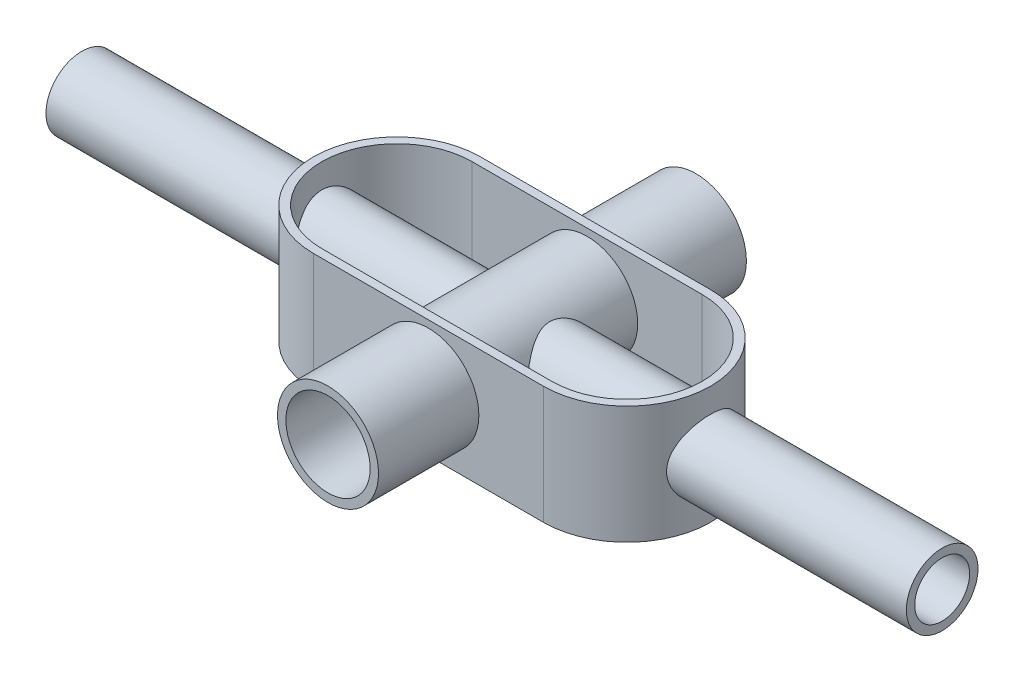
ISO-10303-21;
HEADER;
FILE_DESCRIPTION(('STEP AP214'),'2;1');
FILE_NAME('part.step','',(''),(''),'','','');
FILE_SCHEMA(('AUTOMOTIVE_DESIGN { 1 0 10303 214 1 1 1 1 }'));
ENDSEC;
DATA;
#1=APPLICATION_CONTEXT('core data for automotive mechanical design processes');
#2=APPLICATION_PROTOCOL_DEFINITION('international standard','automotive_design',2000,#1);
#3=PRODUCT_CONTEXT('',#1,'mechanical');
#4=PRODUCT('Part','Part','',(#3));
#5=PRODUCT_RELATED_PRODUCT_CATEGORY('part','',(#4));
#6=PRODUCT_DEFINITION_FORMATION('','',#4);
#7=PRODUCT_DEFINITION_CONTEXT('part definition',#1,'design');
#8=PRODUCT_DEFINITION('design','',#6,#7);
#9=PRODUCT_DEFINITION_SHAPE('','',#8);
#10=(LENGTH_UNIT() NAMED_UNIT(*) SI_UNIT(.MILLI.,.METRE.));
#11=(NAMED_UNIT(*) PLANE_ANGLE_UNIT() SI_UNIT($,.RADIAN.));
#12=(NAMED_UNIT(*) SI_UNIT($,.STERADIAN.) SOLID_ANGLE_UNIT());
#13=UNCERTAINTY_MEASURE_WITH_UNIT(LENGTH_MEASURE(1.E-05),#10,'distance_accuracy_value','');
#14=(GEOMETRIC_REPRESENTATION_CONTEXT(3) GLOBAL_UNCERTAINTY_ASSIGNED_CONTEXT((#13)) GLOBAL_UNIT_ASSIGNED_CONTEXT((#10,
#11,#12)) REPRESENTATION_CONTEXT('',''));
#15=CARTESIAN_POINT('',(0.,0.,0.));
#16=DIRECTION('',(0.,0.,1.));
#17=DIRECTION('',(1.,0.,0.));
#18=AXIS2_PLACEMENT_3D('',#15,#16,#17);
#19=CARTESIAN_POINT('',(0.,18.2999372416086,55.88));
#20=DIRECTION('',(0.,0.,1.));
#21=DIRECTION('',(1.,0.,0.));
#22=AXIS2_PLACEMENT_3D('',#19,#20,#21);
#23=PLANE('',#22);
#24=CARTESIAN_POINT('',(0.,18.2999372416086,55.88));
#25=DIRECTION('',(0.,0.,1.));
#26=DIRECTION('',(1.,0.,0.));
#27=AXIS2_PLACEMENT_3D('',#24,#25,#26);
#28=CIRCLE('',#27,15.3388705459082);
#29=CARTESIAN_POINT('',(15.3388705459082,18.2999372416086,55.88));
#30=VERTEX_POINT('',#29);
#31=EDGE_CURVE('E12',#30,#30,#28,.T.);
#32=ORIENTED_EDGE('',*,*,#31,.T.);
#33=EDGE_LOOP('',(#32));
#34=FACE_BOUND('',#33,.T.);
#35=CARTESIAN_POINT('',(0.,18.2999372416086,55.88));
#36=DIRECTION('',(0.,0.,1.));
#37=DIRECTION('',(1.,0.,0.));
#38=AXIS2_PLACEMENT_3D('',#35,#36,#37);
#39=CIRCLE('',#38,12.7988705459082);
#40=CARTESIAN_POINT('',(12.7988705459082,18.2999372416086,55.88));
#41=VERTEX_POINT('',#40);
#42=EDGE_CURVE('E71',#41,#41,#39,.T.);
#43=ORIENTED_EDGE('',*,*,#42,.F.);
#44=EDGE_LOOP('',(#43));
#45=FACE_BOUND('',#44,.T.);
#46=ADVANCED_FACE('F60',(#34,#45),#23,.T.);
#47=CARTESIAN_POINT('',(0.,18.2999372416086,-55.88));
#48=DIRECTION('',(0.,0.,1.));
#49=DIRECTION('',(1.,0.,0.));
#50=AXIS2_PLACEMENT_3D('',#47,#48,#49);
#51=PLANE('',#50);
#52=CARTESIAN_POINT('',(0.,18.2999372416086,-55.88));
#53=DIRECTION('',(0.,0.,1.));
#54=DIRECTION('',(1.,0.,0.));
#55=AXIS2_PLACEMENT_3D('',#52,#53,#54);
#56=CIRCLE('',#55,15.3388705459082);
#57=CARTESIAN_POINT('',(15.3388705459082,18.2999372416086,-55.88));
#58=VERTEX_POINT('',#57);
#59=EDGE_CURVE('E64',#58,#58,#56,.T.);
#60=ORIENTED_EDGE('',*,*,#59,.F.);
#61=EDGE_LOOP('',(#60));
#62=FACE_BOUND('',#61,.T.);
#63=CARTESIAN_POINT('',(0.,18.2999372416086,-55.88));
#64=DIRECTION('',(0.,0.,1.));
#65=DIRECTION('',(1.,0.,0.));
#66=AXIS2_PLACEMENT_3D('',#63,#64,#65);
#67=CIRCLE('',#66,12.7988705459082);
#68=CARTESIAN_POINT('',(12.7988705459082,18.2999372416086,-55.88));
#69=VERTEX_POINT('',#68);
#70=EDGE_CURVE('E73',#69,#69,#67,.T.);
#71=ORIENTED_EDGE('',*,*,#70,.T.);
#72=EDGE_LOOP('',(#71));
#73=FACE_BOUND('',#72,.T.);
#74=ADVANCED_FACE('F83',(#62,#73),#51,.F.);
#75=CARTESIAN_POINT('',(0.,18.2999372416086,55.88));
#76=DIRECTION('',(0.,0.,-1.));
#77=DIRECTION('',(-1.,0.,0.));
#78=AXIS2_PLACEMENT_3D('',#75,#76,#77);
#79=CYLINDRICAL_SURFACE('',#78,15.3388705459082);
#80=ORIENTED_EDGE('',*,*,#31,.F.);
#81=EDGE_LOOP('',(#80));
#82=FACE_BOUND('',#81,.T.);
#83=ORIENTED_EDGE('',*,*,#59,.T.);
#84=EDGE_LOOP('',(#83));
#85=FACE_BOUND('',#84,.T.);
#86=ADVANCED_FACE('F62',(#82,#85),#79,.T.);
#87=CARTESIAN_POINT('',(0.,18.2999372416086,55.88));
#88=DIRECTION('',(0.,0.,-1.));
#89=DIRECTION('',(-1.,0.,0.));
#90=AXIS2_PLACEMENT_3D('',#87,#88,#89);
#91=CYLINDRICAL_SURFACE('',#90,12.7988705459082);
#92=ORIENTED_EDGE('',*,*,#42,.T.);
#93=EDGE_LOOP('',(#92));
#94=FACE_BOUND('',#93,.T.);
#95=ORIENTED_EDGE('',*,*,#70,.F.);
#96=EDGE_LOOP('',(#95));
#97=FACE_BOUND('',#96,.T.);
#98=ADVANCED_FACE('F79',(#94,#97),#91,.F.);
#99=CLOSED_SHELL('',(#46,#74,#86,#98));
#100=MANIFOLD_SOLID_BREP('B2_NOT_SHOWN',#99);
#101=CARTESIAN_POINT('',(-34.9421284780553,35.814,0.));
#102=DIRECTION('',(0.,-1.,0.));
#103=DIRECTION('',(0.,0.,-1.));
#104=AXIS2_PLACEMENT_3D('',#101,#102,#103);
#105=CYLINDRICAL_SURFACE('',#104,25.3926070383726);
#106=CARTESIAN_POINT('',(-34.9421284780553,0.,0.));
#107=DIRECTION('',(0.,1.,0.));
#108=DIRECTION('',(0.,0.,1.));
#109=AXIS2_PLACEMENT_3D('',#106,#107,#108);
#110=CIRCLE('',#109,25.3926070383726);
#111=CARTESIAN_POINT('',(-34.9421284780553,0.,-25.3926070383726));
#112=VERTEX_POINT('',#111);
#113=CARTESIAN_POINT('',(-34.9421284780553,0.,25.3926070383726));
#114=VERTEX_POINT('',#113);
#115=EDGE_CURVE('E243',#112,#114,#110,.T.);
#116=ORIENTED_EDGE('',*,*,#115,.T.);
#117=DIRECTION('',(0.,-1.,0.));
#118=VECTOR('',#117,1.);
#119=CARTESIAN_POINT('',(-34.9421284780553,35.814,25.3926070383726));
#120=LINE('',#119,#118);
#121=CARTESIAN_POINT('',(-34.9421284780553,35.814,25.3926070383726));
#122=VERTEX_POINT('',#121);
#123=EDGE_CURVE('E58',#122,#114,#120,.T.);
#124=ORIENTED_EDGE('',*,*,#123,.F.);
#125=CARTESIAN_POINT('',(-34.9421284780553,35.814,0.));
#126=DIRECTION('',(0.,1.,0.));
#127=DIRECTION('',(0.,0.,1.));
#128=AXIS2_PLACEMENT_3D('',#125,#126,#127);
#129=CIRCLE('',#128,25.3926070383726);
#130=CARTESIAN_POINT('',(-34.9421284780553,35.814,-25.3926070383726));
#131=VERTEX_POINT('',#130);
#132=EDGE_CURVE('E236',#131,#122,#129,.T.);
#133=ORIENTED_EDGE('',*,*,#132,.F.);
#134=DIRECTION('',(0.,-1.,0.));
#135=VECTOR('',#134,1.);
#136=CARTESIAN_POINT('',(-34.9421284780553,35.814,-25.3926070383726));
#137=LINE('',#136,#135);
#138=EDGE_CURVE('E242',#131,#112,#137,.T.);
#139=ORIENTED_EDGE('',*,*,#138,.T.);
#140=EDGE_LOOP('',(#116,#124,#133,#139));
#141=FACE_BOUND('',#140,.T.);
#142=ADVANCED_FACE('F129',(#141),#105,.T.);
#143=CARTESIAN_POINT('',(-34.9421284780553,35.814,25.3926070383726));
#144=DIRECTION('',(0.,0.,-1.));
#145=DIRECTION('',(-1.,0.,0.));
#146=AXIS2_PLACEMENT_3D('',#143,#144,#145);
#147=PLANE('',#146);
#148=DIRECTION('',(1.,0.,0.));
#149=VECTOR('',#148,1.);
#150=CARTESIAN_POINT('',(-34.9421284780553,0.,25.3926070383726));
#151=LINE('',#150,#149);
#152=CARTESIAN_POINT('',(34.9421284780553,0.,25.3926070383726));
#153=VERTEX_POINT('',#152);
#154=EDGE_CURVE('E246',#114,#153,#151,.T.);
#155=ORIENTED_EDGE('',*,*,#154,.T.);
#156=DIRECTION('',(0.,-1.,0.));
#157=VECTOR('',#156,1.);
#158=CARTESIAN_POINT('',(34.9421284780553,35.814,25.3926070383726));
#159=LINE('',#158,#157);
#160=CARTESIAN_POINT('',(34.9421284780553,35.814,25.3926070383726));
#161=VERTEX_POINT('',#160);
#162=EDGE_CURVE('E136',#161,#153,#159,.T.);
#163=ORIENTED_EDGE('',*,*,#162,.F.);
#164=DIRECTION('',(1.,0.,0.));
#165=VECTOR('',#164,1.);
#166=CARTESIAN_POINT('',(-34.9421284780553,35.814,25.3926070383726));
#167=LINE('',#166,#165);
#168=EDGE_CURVE('E180',#122,#161,#167,.T.);
#169=ORIENTED_EDGE('',*,*,#168,.F.);
#170=ORIENTED_EDGE('',*,*,#123,.T.);
#171=EDGE_LOOP('',(#155,#163,#169,#170));
#172=FACE_BOUND('',#171,.T.);
#173=ADVANCED_FACE('F275',(#172),#147,.F.);
#174=CARTESIAN_POINT('',(34.9421284780553,35.814,0.));
#175=DIRECTION('',(0.,-1.,0.));
#176=DIRECTION('',(0.,0.,-1.));
#177=AXIS2_PLACEMENT_3D('',#174,#175,#176);
#178=CYLINDRICAL_SURFACE('',#177,25.3926070383726);
#179=CARTESIAN_POINT('',(34.9421284780553,0.,0.));
#180=DIRECTION('',(0.,1.,0.));
#181=DIRECTION('',(0.,0.,1.));
#182=AXIS2_PLACEMENT_3D('',#179,#180,#181);
#183=CIRCLE('',#182,25.3926070383726);
#184=CARTESIAN_POINT('',(34.9421284780553,0.,-25.3926070383726));
#185=VERTEX_POINT('',#184);
#186=EDGE_CURVE('E248',#153,#185,#183,.T.);
#187=ORIENTED_EDGE('',*,*,#186,.T.);
#188=DIRECTION('',(0.,-1.,0.));
#189=VECTOR('',#188,1.);
#190=CARTESIAN_POINT('',(34.9421284780553,35.814,-25.3926070383726));
#191=LINE('',#190,#189);
#192=CARTESIAN_POINT('',(34.9421284780553,35.814,-25.3926070383726));
#193=VERTEX_POINT('',#192);
#194=EDGE_CURVE('E252',#193,#185,#191,.T.);
#195=ORIENTED_EDGE('',*,*,#194,.F.);
#196=CARTESIAN_POINT('',(34.9421284780553,35.814,0.));
#197=DIRECTION('',(0.,1.,0.));
#198=DIRECTION('',(0.,0.,1.));
#199=AXIS2_PLACEMENT_3D('',#196,#197,#198);
#200=CIRCLE('',#199,25.3926070383726);
#201=EDGE_CURVE('E239',#161,#193,#200,.T.);
#202=ORIENTED_EDGE('',*,*,#201,.F.);
#203=ORIENTED_EDGE('',*,*,#162,.T.);
#204=EDGE_LOOP('',(#187,#195,#202,#203));
#205=FACE_BOUND('',#204,.T.);
#206=ADVANCED_FACE('F257',(#205),#178,.T.);
#207=CARTESIAN_POINT('',(-34.9421284780553,35.814,-25.3926070383726));
#208=DIRECTION('',(0.,0.,1.));
#209=DIRECTION('',(1.,0.,0.));
#210=AXIS2_PLACEMENT_3D('',#207,#208,#209);
#211=PLANE('',#210);
#212=DIRECTION('',(-1.,0.,0.));
#213=VECTOR('',#212,1.);
#214=CARTESIAN_POINT('',(-34.9421284780553,0.,-25.3926070383726));
#215=LINE('',#214,#213);
#216=EDGE_CURVE('E173',#185,#112,#215,.T.);
#217=ORIENTED_EDGE('',*,*,#216,.T.);
#218=ORIENTED_EDGE('',*,*,#138,.F.);
#219=DIRECTION('',(-1.,0.,0.));
#220=VECTOR('',#219,1.);
#221=CARTESIAN_POINT('',(-34.9421284780553,35.814,-25.3926070383726));
#222=LINE('',#221,#220);
#223=EDGE_CURVE('E152',#193,#131,#222,.T.);
#224=ORIENTED_EDGE('',*,*,#223,.F.);
#225=ORIENTED_EDGE('',*,*,#194,.T.);
#226=EDGE_LOOP('',(#217,#218,#224,#225));
#227=FACE_BOUND('',#226,.T.);
#228=ADVANCED_FACE('F265',(#227),#211,.F.);
#229=CARTESIAN_POINT('',(-34.9421284780553,35.814,0.));
#230=DIRECTION('',(0.,1.,0.));
#231=DIRECTION('',(0.,0.,1.));
#232=AXIS2_PLACEMENT_3D('',#229,#230,#231);
#233=PLANE('',#232);
#234=CARTESIAN_POINT('',(-34.9421284780553,35.814,0.));
#235=DIRECTION('',(0.,1.,0.));
#236=DIRECTION('',(0.,0.,1.));
#237=AXIS2_PLACEMENT_3D('',#234,#235,#236);
#238=CIRCLE('',#237,22.8526070383726);
#239=CARTESIAN_POINT('',(-34.9421284780553,35.814,-22.8526070383726));
#240=VERTEX_POINT('',#239);
#241=CARTESIAN_POINT('',(-34.9421284780553,35.814,22.8526070383726));
#242=VERTEX_POINT('',#241);
#243=EDGE_CURVE('E225',#240,#242,#238,.T.);
#244=ORIENTED_EDGE('',*,*,#243,.F.);
#245=DIRECTION('',(-1.,0.,0.));
#246=VECTOR('',#245,1.);
#247=CARTESIAN_POINT('',(-34.9421284780553,35.814,-22.8526070383726));
#248=LINE('',#247,#246);
#249=CARTESIAN_POINT('',(34.9421284780553,35.814,-22.8526070383726));
#250=VERTEX_POINT('',#249);
#251=EDGE_CURVE('E234',#250,#240,#248,.T.);
#252=ORIENTED_EDGE('',*,*,#251,.F.);
#253=CARTESIAN_POINT('',(34.9421284780553,35.814,0.));
#254=DIRECTION('',(0.,1.,0.));
#255=DIRECTION('',(0.,0.,1.));
#256=AXIS2_PLACEMENT_3D('',#253,#254,#255);
#257=CIRCLE('',#256,22.8526070383726);
#258=CARTESIAN_POINT('',(34.9421284780553,35.814,22.8526070383726));
#259=VERTEX_POINT('',#258);
#260=EDGE_CURVE('E232',#259,#250,#257,.T.);
#261=ORIENTED_EDGE('',*,*,#260,.F.);
#262=DIRECTION('',(1.,0.,0.));
#263=VECTOR('',#262,1.);
#264=CARTESIAN_POINT('',(-34.9421284780553,35.814,22.8526070383726));
#265=LINE('',#264,#263);
#266=EDGE_CURVE('E217',#242,#259,#265,.T.);
#267=ORIENTED_EDGE('',*,*,#266,.F.);
#268=EDGE_LOOP('',(#244,#252,#261,#267));
#269=FACE_BOUND('',#268,.T.);
#270=ORIENTED_EDGE('',*,*,#132,.T.);
#271=ORIENTED_EDGE('',*,*,#168,.T.);
#272=ORIENTED_EDGE('',*,*,#201,.T.);
#273=ORIENTED_EDGE('',*,*,#223,.T.);
#274=EDGE_LOOP('',(#270,#271,#272,#273));
#275=FACE_BOUND('',#274,.T.);
#276=ADVANCED_FACE('F267',(#269,#275),#233,.T.);
#277=CARTESIAN_POINT('',(-34.9421284780553,0.,0.));
#278=DIRECTION('',(0.,1.,0.));
#279=DIRECTION('',(0.,0.,1.));
#280=AXIS2_PLACEMENT_3D('',#277,#278,#279);
#281=PLANE('',#280);
#282=ORIENTED_EDGE('',*,*,#115,.F.);
#283=ORIENTED_EDGE('',*,*,#216,.F.);
#284=ORIENTED_EDGE('',*,*,#186,.F.);
#285=ORIENTED_EDGE('',*,*,#154,.F.);
#286=EDGE_LOOP('',(#282,#283,#284,#285));
#287=FACE_BOUND('',#286,.T.);
#288=ADVANCED_FACE('F261',(#287),#281,.F.);
#289=CARTESIAN_POINT('',(-34.9421284780553,35.814,0.));
#290=DIRECTION('',(0.,-1.,0.));
#291=DIRECTION('',(0.,0.,-1.));
#292=AXIS2_PLACEMENT_3D('',#289,#290,#291);
#293=CYLINDRICAL_SURFACE('',#292,22.8526070383726);
#294=CARTESIAN_POINT('',(-34.9421284780553,2.54,0.));
#295=DIRECTION('',(0.,1.,0.));
#296=DIRECTION('',(0.,0.,1.));
#297=AXIS2_PLACEMENT_3D('',#294,#295,#296);
#298=CIRCLE('',#297,22.8526070383726);
#299=CARTESIAN_POINT('',(-34.9421284780553,2.54,-22.8526070383726));
#300=VERTEX_POINT('',#299);
#301=CARTESIAN_POINT('',(-34.9421284780553,2.54,22.8526070383726));
#302=VERTEX_POINT('',#301);
#303=EDGE_CURVE('E208',#300,#302,#298,.T.);
#304=ORIENTED_EDGE('',*,*,#303,.F.);
#305=DIRECTION('',(0.,-1.,0.));
#306=VECTOR('',#305,1.);
#307=CARTESIAN_POINT('',(-34.9421284780553,35.814,-22.8526070383726));
#308=LINE('',#307,#306);
#309=EDGE_CURVE('E228',#240,#300,#308,.T.);
#310=ORIENTED_EDGE('',*,*,#309,.F.);
#311=ORIENTED_EDGE('',*,*,#243,.T.);
#312=DIRECTION('',(0.,1.,0.));
#313=VECTOR('',#312,1.);
#314=CARTESIAN_POINT('',(-34.9421284780553,35.814,22.8526070383726));
#315=LINE('',#314,#313);
#316=EDGE_CURVE('E220',#242,#302,#315,.F.);
#317=ORIENTED_EDGE('',*,*,#316,.T.);
#318=EDGE_LOOP('',(#304,#310,#311,#317));
#319=FACE_BOUND('',#318,.T.);
#320=ADVANCED_FACE('F307',(#319),#293,.F.);
#321=CARTESIAN_POINT('',(-34.9421284780553,35.814,22.8526070383726));
#322=DIRECTION('',(0.,0.,-1.));
#323=DIRECTION('',(-1.,0.,0.));
#324=AXIS2_PLACEMENT_3D('',#321,#322,#323);
#325=PLANE('',#324);
#326=DIRECTION('',(1.,0.,0.));
#327=VECTOR('',#326,1.);
#328=CARTESIAN_POINT('',(-34.9421284780553,2.54,22.8526070383726));
#329=LINE('',#328,#327);
#330=CARTESIAN_POINT('',(34.9421284780553,2.54,22.8526070383726));
#331=VERTEX_POINT('',#330);
#332=EDGE_CURVE('E202',#302,#331,#329,.T.);
#333=ORIENTED_EDGE('',*,*,#332,.F.);
#334=ORIENTED_EDGE('',*,*,#316,.F.);
#335=ORIENTED_EDGE('',*,*,#266,.T.);
#336=DIRECTION('',(0.,-1.,0.));
#337=VECTOR('',#336,1.);
#338=CARTESIAN_POINT('',(34.9421284780553,35.814,22.8526070383726));
#339=LINE('',#338,#337);
#340=EDGE_CURVE('E214',#259,#331,#339,.T.);
#341=ORIENTED_EDGE('',*,*,#340,.T.);
#342=EDGE_LOOP('',(#333,#334,#335,#341));
#343=FACE_BOUND('',#342,.T.);
#344=ADVANCED_FACE('F215',(#343),#325,.T.);
#345=CARTESIAN_POINT('',(34.9421284780553,35.814,0.));
#346=DIRECTION('',(0.,-1.,0.));
#347=DIRECTION('',(0.,0.,-1.));
#348=AXIS2_PLACEMENT_3D('',#345,#346,#347);
#349=CYLINDRICAL_SURFACE('',#348,22.8526070383726);
#350=CARTESIAN_POINT('',(34.9421284780553,2.54,0.));
#351=DIRECTION('',(0.,1.,0.));
#352=DIRECTION('',(0.,0.,1.));
#353=AXIS2_PLACEMENT_3D('',#350,#351,#352);
#354=CIRCLE('',#353,22.8526070383726);
#355=CARTESIAN_POINT('',(34.9421284780553,2.54,-22.8526070383726));
#356=VERTEX_POINT('',#355);
#357=EDGE_CURVE('E206',#331,#356,#354,.T.);
#358=ORIENTED_EDGE('',*,*,#357,.F.);
#359=ORIENTED_EDGE('',*,*,#340,.F.);
#360=ORIENTED_EDGE('',*,*,#260,.T.);
#361=DIRECTION('',(0.,1.,0.));
#362=VECTOR('',#361,1.);
#363=CARTESIAN_POINT('',(34.9421284780553,35.814,-22.8526070383726));
#364=LINE('',#363,#362);
#365=EDGE_CURVE('E143',#250,#356,#364,.F.);
#366=ORIENTED_EDGE('',*,*,#365,.T.);
#367=EDGE_LOOP('',(#358,#359,#360,#366));
#368=FACE_BOUND('',#367,.T.);
#369=ADVANCED_FACE('F222',(#368),#349,.F.);
#370=CARTESIAN_POINT('',(-34.9421284780553,35.814,-22.8526070383726));
#371=DIRECTION('',(0.,0.,1.));
#372=DIRECTION('',(1.,0.,0.));
#373=AXIS2_PLACEMENT_3D('',#370,#371,#372);
#374=PLANE('',#373);
#375=DIRECTION('',(-1.,0.,0.));
#376=VECTOR('',#375,1.);
#377=CARTESIAN_POINT('',(-34.9421284780553,2.54,-22.8526070383726));
#378=LINE('',#377,#376);
#379=EDGE_CURVE('E223',#356,#300,#378,.T.);
#380=ORIENTED_EDGE('',*,*,#379,.F.);
#381=ORIENTED_EDGE('',*,*,#365,.F.);
#382=ORIENTED_EDGE('',*,*,#251,.T.);
#383=ORIENTED_EDGE('',*,*,#309,.T.);
#384=EDGE_LOOP('',(#380,#381,#382,#383));
#385=FACE_BOUND('',#384,.T.);
#386=ADVANCED_FACE('F329',(#385),#374,.T.);
#387=CARTESIAN_POINT('',(-34.9421284780553,2.54,0.));
#388=DIRECTION('',(0.,1.,0.));
#389=DIRECTION('',(0.,0.,1.));
#390=AXIS2_PLACEMENT_3D('',#387,#388,#389);
#391=PLANE('',#390);
#392=ORIENTED_EDGE('',*,*,#303,.T.);
#393=ORIENTED_EDGE('',*,*,#332,.T.);
#394=ORIENTED_EDGE('',*,*,#357,.T.);
#395=ORIENTED_EDGE('',*,*,#379,.T.);
#396=EDGE_LOOP('',(#392,#393,#394,#395));
#397=FACE_BOUND('',#396,.T.);
#398=ADVANCED_FACE('F204',(#397),#391,.T.);
#399=CLOSED_SHELL('',(#142,#173,#206,#228,#276,#288,#320,#344,#369,#386,#398));
#400=MANIFOLD_SOLID_BREP('B7',#399);
#401=CARTESIAN_POINT('',(130.683,17.5252479371108,0.));
#402=DIRECTION('',(1.,0.,0.));
#403=DIRECTION('',(0.,0.,-1.));
#404=AXIS2_PLACEMENT_3D('',#401,#402,#403);
#405=PLANE('',#404);
#406=CARTESIAN_POINT('',(130.683,17.5252479371108,0.));
#407=DIRECTION('',(1.,0.,0.));
#408=DIRECTION('',(0.,0.,-1.));
#409=AXIS2_PLACEMENT_3D('',#406,#407,#408);
#410=CIRCLE('',#409,10.8842691789706);
#411=CARTESIAN_POINT('',(130.683,17.5252479371108,-10.8842691789706));
#412=VERTEX_POINT('',#411);
#413=EDGE_CURVE('E128',#412,#412,#410,.T.);
#414=ORIENTED_EDGE('',*,*,#413,.T.);
#415=EDGE_LOOP('',(#414));
#416=FACE_BOUND('',#415,.T.);
#417=CARTESIAN_POINT('',(130.683,17.5252479371108,0.));
#418=DIRECTION('',(1.,0.,0.));
#419=DIRECTION('',(0.,0.,-1.));
#420=AXIS2_PLACEMENT_3D('',#417,#418,#419);
#421=CIRCLE('',#420,8.34426917897061);
#422=CARTESIAN_POINT('',(130.683,17.5252479371108,-8.34426917897061));
#423=VERTEX_POINT('',#422);
#424=EDGE_CURVE('E379',#423,#423,#421,.T.);
#425=ORIENTED_EDGE('',*,*,#424,.F.);
#426=EDGE_LOOP('',(#425));
#427=FACE_BOUND('',#426,.T.);
#428=ADVANCED_FACE('F368',(#416,#427),#405,.T.);
#429=CARTESIAN_POINT('',(-130.683,17.5252479371108,0.));
#430=DIRECTION('',(1.,0.,0.));
#431=DIRECTION('',(0.,0.,-1.));
#432=AXIS2_PLACEMENT_3D('',#429,#430,#431);
#433=PLANE('',#432);
#434=CARTESIAN_POINT('',(-130.683,17.5252479371108,0.));
#435=DIRECTION('',(1.,0.,0.));
#436=DIRECTION('',(0.,0.,-1.));
#437=AXIS2_PLACEMENT_3D('',#434,#435,#436);
#438=CIRCLE('',#437,10.8842691789706);
#439=CARTESIAN_POINT('',(-130.683,17.5252479371108,-10.8842691789706));
#440=VERTEX_POINT('',#439);
#441=EDGE_CURVE('E372',#440,#440,#438,.T.);
#442=ORIENTED_EDGE('',*,*,#441,.F.);
#443=EDGE_LOOP('',(#442));
#444=FACE_BOUND('',#443,.T.);
#445=CARTESIAN_POINT('',(-130.683,17.5252479371108,0.));
#446=DIRECTION('',(1.,0.,0.));
#447=DIRECTION('',(0.,0.,-1.));
#448=AXIS2_PLACEMENT_3D('',#445,#446,#447);
#449=CIRCLE('',#448,8.34426917897061);
#450=CARTESIAN_POINT('',(-130.683,17.5252479371108,-8.34426917897061));
#451=VERTEX_POINT('',#450);
#452=EDGE_CURVE('E381',#451,#451,#449,.T.);
#453=ORIENTED_EDGE('',*,*,#452,.T.);
#454=EDGE_LOOP('',(#453));
#455=FACE_BOUND('',#454,.T.);
#456=ADVANCED_FACE('F391',(#444,#455),#433,.F.);
#457=CARTESIAN_POINT('',(130.683,17.5252479371108,0.));
#458=DIRECTION('',(-1.,0.,0.));
#459=DIRECTION('',(0.,0.,1.));
#460=AXIS2_PLACEMENT_3D('',#457,#458,#459);
#461=CYLINDRICAL_SURFACE('',#460,10.8842691789706);
#462=ORIENTED_EDGE('',*,*,#413,.F.);
#463=EDGE_LOOP('',(#462));
#464=FACE_BOUND('',#463,.T.);
#465=ORIENTED_EDGE('',*,*,#441,.T.);
#466=EDGE_LOOP('',(#465));
#467=FACE_BOUND('',#466,.T.);
#468=ADVANCED_FACE('F370',(#464,#467),#461,.T.);
#469=CARTESIAN_POINT('',(130.683,17.5252479371108,0.));
#470=DIRECTION('',(-1.,0.,0.));
#471=DIRECTION('',(0.,0.,1.));
#472=AXIS2_PLACEMENT_3D('',#469,#470,#471);
#473=CYLINDRICAL_SURFACE('',#472,8.34426917897061);
#474=ORIENTED_EDGE('',*,*,#424,.T.);
#475=EDGE_LOOP('',(#474));
#476=FACE_BOUND('',#475,.T.);
#477=ORIENTED_EDGE('',*,*,#452,.F.);
#478=EDGE_LOOP('',(#477));
#479=FACE_BOUND('',#478,.T.);
#480=ADVANCED_FACE('F387',(#476,#479),#473,.F.);
#481=CLOSED_SHELL('',(#428,#456,#468,#480));
#482=MANIFOLD_SOLID_BREP('B52',#481);
#483=ADVANCED_BREP_SHAPE_REPRESENTATION('',(#18,#100,#400,#482),#14);
#484=SHAPE_DEFINITION_REPRESENTATION(#9,#483);
ENDSEC;
END-ISO-10303-21;
